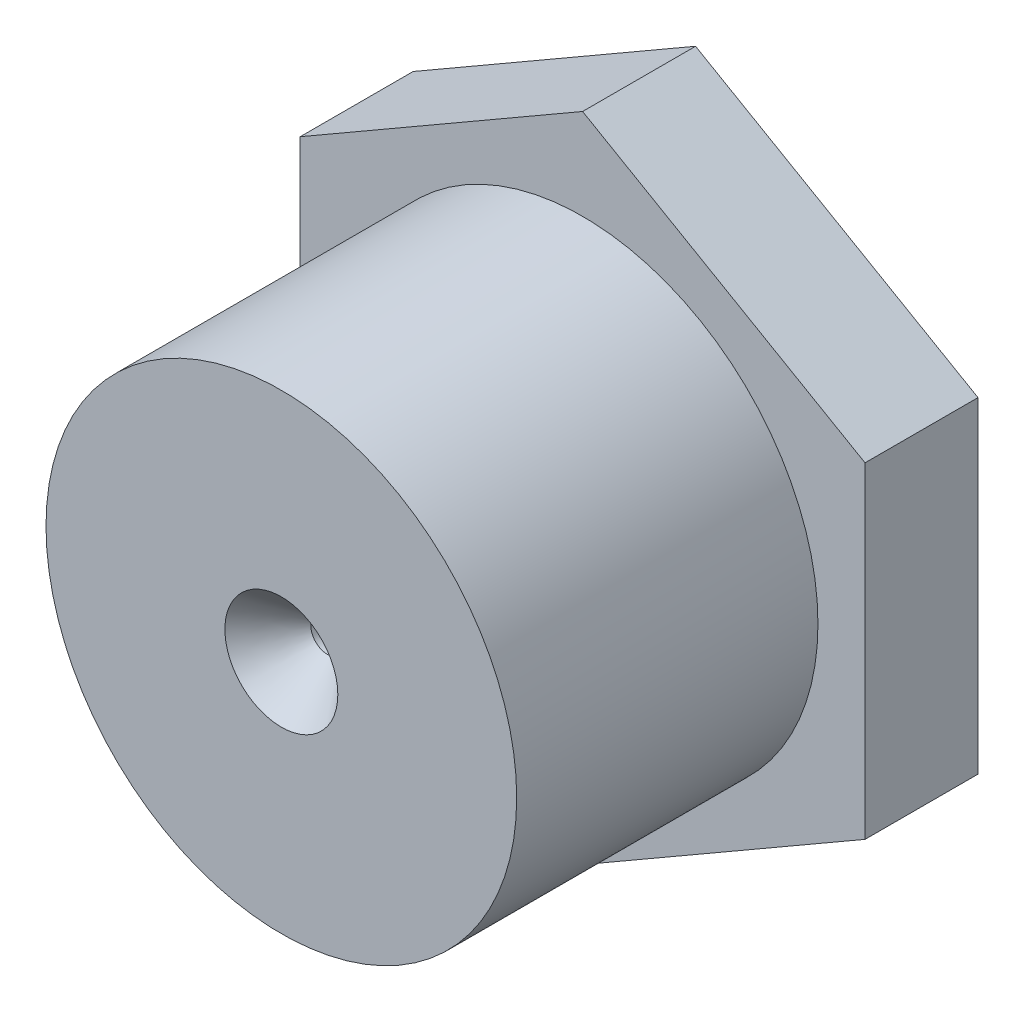
ISO-10303-21;
HEADER;
FILE_DESCRIPTION(('STEP AP214'),'2;1');
FILE_NAME('part.step','',(''),(''),'','','');
FILE_SCHEMA(('AUTOMOTIVE_DESIGN { 1 0 10303 214 1 1 1 1 }'));
ENDSEC;
DATA;
#1=APPLICATION_CONTEXT('core data for automotive mechanical design processes');
#2=APPLICATION_PROTOCOL_DEFINITION('international standard','automotive_design',2000,#1);
#3=PRODUCT_CONTEXT('',#1,'mechanical');
#4=PRODUCT('Part','Part','',(#3));
#5=PRODUCT_RELATED_PRODUCT_CATEGORY('part','',(#4));
#6=PRODUCT_DEFINITION_FORMATION('','',#4);
#7=PRODUCT_DEFINITION_CONTEXT('part definition',#1,'design');
#8=PRODUCT_DEFINITION('design','',#6,#7);
#9=PRODUCT_DEFINITION_SHAPE('','',#8);
#10=(LENGTH_UNIT() NAMED_UNIT(*) SI_UNIT(.MILLI.,.METRE.));
#11=(NAMED_UNIT(*) PLANE_ANGLE_UNIT() SI_UNIT($,.RADIAN.));
#12=(NAMED_UNIT(*) SI_UNIT($,.STERADIAN.) SOLID_ANGLE_UNIT());
#13=UNCERTAINTY_MEASURE_WITH_UNIT(LENGTH_MEASURE(1.E-05),#10,'distance_accuracy_value','');
#14=(GEOMETRIC_REPRESENTATION_CONTEXT(3) GLOBAL_UNCERTAINTY_ASSIGNED_CONTEXT((#13)) GLOBAL_UNIT_ASSIGNED_CONTEXT((#10,
#11,#12)) REPRESENTATION_CONTEXT('',''));
#15=CARTESIAN_POINT('',(0.,0.,0.));
#16=DIRECTION('',(0.,0.,1.));
#17=DIRECTION('',(1.,0.,0.));
#18=AXIS2_PLACEMENT_3D('',#15,#16,#17);
#19=CARTESIAN_POINT('',(0.,17.3205080756888,0.));
#20=DIRECTION('',(0.,0.,1.));
#21=DIRECTION('',(1.,0.,0.));
#22=AXIS2_PLACEMENT_3D('',#19,#20,#21);
#23=PLANE('',#22);
#24=DIRECTION('',(-0.866025403784439,0.5,0.));
#25=VECTOR('',#24,1.);
#26=CARTESIAN_POINT('',(15.,8.6602540378444,0.));
#27=LINE('',#26,#25);
#28=CARTESIAN_POINT('',(15.,8.6602540378444,0.));
#29=VERTEX_POINT('',#28);
#30=CARTESIAN_POINT('',(0.,17.3205080756888,0.));
#31=VERTEX_POINT('',#30);
#32=EDGE_CURVE('E120',#29,#31,#27,.T.);
#33=ORIENTED_EDGE('',*,*,#32,.F.);
#34=DIRECTION('',(0.,1.,0.));
#35=VECTOR('',#34,1.);
#36=CARTESIAN_POINT('',(15.,-8.66025403784439,0.));
#37=LINE('',#36,#35);
#38=CARTESIAN_POINT('',(15.,-8.66025403784439,0.));
#39=VERTEX_POINT('',#38);
#40=EDGE_CURVE('E80',#39,#29,#37,.T.);
#41=ORIENTED_EDGE('',*,*,#40,.F.);
#42=DIRECTION('',(0.866025403784439,0.5,0.));
#43=VECTOR('',#42,1.);
#44=CARTESIAN_POINT('',(0.,-17.3205080756888,0.));
#45=LINE('',#44,#43);
#46=CARTESIAN_POINT('',(0.,-17.3205080756888,0.));
#47=VERTEX_POINT('',#46);
#48=EDGE_CURVE('E74',#47,#39,#45,.T.);
#49=ORIENTED_EDGE('',*,*,#48,.F.);
#50=DIRECTION('',(0.866025403784439,-0.5,0.));
#51=VECTOR('',#50,1.);
#52=CARTESIAN_POINT('',(-15.,-8.66025403784439,0.));
#53=LINE('',#52,#51);
#54=CARTESIAN_POINT('',(-15.,-8.66025403784439,0.));
#55=VERTEX_POINT('',#54);
#56=EDGE_CURVE('E110',#55,#47,#53,.T.);
#57=ORIENTED_EDGE('',*,*,#56,.F.);
#58=DIRECTION('',(0.,-1.,0.));
#59=VECTOR('',#58,1.);
#60=CARTESIAN_POINT('',(-15.,8.66025403784439,0.));
#61=LINE('',#60,#59);
#62=CARTESIAN_POINT('',(-15.,8.66025403784439,0.));
#63=VERTEX_POINT('',#62);
#64=EDGE_CURVE('E126',#63,#55,#61,.T.);
#65=ORIENTED_EDGE('',*,*,#64,.F.);
#66=DIRECTION('',(-0.866025403784439,-0.5,0.));
#67=VECTOR('',#66,1.);
#68=CARTESIAN_POINT('',(0.,17.3205080756888,0.));
#69=LINE('',#68,#67);
#70=EDGE_CURVE('E123',#31,#63,#69,.T.);
#71=ORIENTED_EDGE('',*,*,#70,.F.);
#72=EDGE_LOOP('',(#33,#41,#49,#57,#65,#71));
#73=FACE_BOUND('',#72,.T.);
#74=CARTESIAN_POINT('',(0.,0.,0.));
#75=DIRECTION('',(0.,0.,1.));
#76=DIRECTION('',(1.,0.,0.));
#77=AXIS2_PLACEMENT_3D('',#74,#75,#76);
#78=CIRCLE('',#77,1.50000000000001);
#79=CARTESIAN_POINT('',(1.50000000000001,0.,0.));
#80=VERTEX_POINT('',#79);
#81=EDGE_CURVE('E183',#80,#80,#78,.T.);
#82=ORIENTED_EDGE('',*,*,#81,.T.);
#83=EDGE_LOOP('',(#82));
#84=FACE_BOUND('',#83,.T.);
#85=ADVANCED_FACE('F33',(#73,#84),#23,.F.);
#86=CARTESIAN_POINT('',(0.,0.,22.));
#87=DIRECTION('',(0.,0.,1.));
#88=DIRECTION('',(1.,0.,0.));
#89=AXIS2_PLACEMENT_3D('',#86,#87,#88);
#90=CYLINDRICAL_SURFACE('',#89,0.875000000000006);
#91=CARTESIAN_POINT('',(0.,0.,19.5554671346554));
#92=DIRECTION('',(0.,0.,1.));
#93=DIRECTION('',(1.,0.,0.));
#94=AXIS2_PLACEMENT_3D('',#91,#92,#93);
#95=CIRCLE('',#94,0.875000000000012);
#96=CARTESIAN_POINT('',(0.875000000000012,0.,19.5554671346554));
#97=VERTEX_POINT('',#96);
#98=EDGE_CURVE('E189',#97,#97,#95,.T.);
#99=ORIENTED_EDGE('',*,*,#98,.T.);
#100=EDGE_LOOP('',(#99));
#101=FACE_BOUND('',#100,.T.);
#102=CARTESIAN_POINT('',(0.,0.,0.625000000000004));
#103=DIRECTION('',(0.,0.,-1.));
#104=DIRECTION('',(-1.,0.,0.));
#105=AXIS2_PLACEMENT_3D('',#102,#103,#104);
#106=CIRCLE('',#105,0.875000000000006);
#107=CARTESIAN_POINT('',(-0.875000000000009,0.,0.624999999999999));
#108=VERTEX_POINT('',#107);
#109=EDGE_CURVE('E37',#108,#108,#106,.F.);
#110=ORIENTED_EDGE('',*,*,#109,.F.);
#111=EDGE_LOOP('',(#110));
#112=FACE_BOUND('',#111,.T.);
#113=ADVANCED_FACE('F159',(#101,#112),#90,.F.);
#114=CARTESIAN_POINT('',(0.,17.3205080756888,6.));
#115=DIRECTION('',(0.,0.,1.));
#116=DIRECTION('',(1.,0.,0.));
#117=AXIS2_PLACEMENT_3D('',#114,#115,#116);
#118=PLANE('',#117);
#119=DIRECTION('',(-0.866025403784439,0.5,0.));
#120=VECTOR('',#119,1.);
#121=CARTESIAN_POINT('',(15.,8.6602540378444,6.));
#122=LINE('',#121,#120);
#123=CARTESIAN_POINT('',(15.,8.6602540378444,6.));
#124=VERTEX_POINT('',#123);
#125=CARTESIAN_POINT('',(0.,17.3205080756888,6.));
#126=VERTEX_POINT('',#125);
#127=EDGE_CURVE('E131',#124,#126,#122,.T.);
#128=ORIENTED_EDGE('',*,*,#127,.T.);
#129=DIRECTION('',(-0.866025403784439,-0.5,0.));
#130=VECTOR('',#129,1.);
#131=CARTESIAN_POINT('',(0.,17.3205080756888,6.));
#132=LINE('',#131,#130);
#133=CARTESIAN_POINT('',(-15.,8.66025403784439,6.));
#134=VERTEX_POINT('',#133);
#135=EDGE_CURVE('E88',#126,#134,#132,.T.);
#136=ORIENTED_EDGE('',*,*,#135,.T.);
#137=DIRECTION('',(0.,-1.,0.));
#138=VECTOR('',#137,1.);
#139=CARTESIAN_POINT('',(-15.,8.66025403784439,6.));
#140=LINE('',#139,#138);
#141=CARTESIAN_POINT('',(-15.,-8.66025403784439,6.));
#142=VERTEX_POINT('',#141);
#143=EDGE_CURVE('E102',#134,#142,#140,.T.);
#144=ORIENTED_EDGE('',*,*,#143,.T.);
#145=DIRECTION('',(0.866025403784439,-0.5,0.));
#146=VECTOR('',#145,1.);
#147=CARTESIAN_POINT('',(-15.,-8.66025403784439,6.));
#148=LINE('',#147,#146);
#149=CARTESIAN_POINT('',(0.,-17.3205080756888,6.));
#150=VERTEX_POINT('',#149);
#151=EDGE_CURVE('E95',#142,#150,#148,.T.);
#152=ORIENTED_EDGE('',*,*,#151,.T.);
#153=DIRECTION('',(0.866025403784439,0.5,0.));
#154=VECTOR('',#153,1.);
#155=CARTESIAN_POINT('',(0.,-17.3205080756888,6.));
#156=LINE('',#155,#154);
#157=CARTESIAN_POINT('',(15.,-8.66025403784439,6.));
#158=VERTEX_POINT('',#157);
#159=EDGE_CURVE('E100',#150,#158,#156,.T.);
#160=ORIENTED_EDGE('',*,*,#159,.T.);
#161=DIRECTION('',(0.,1.,0.));
#162=VECTOR('',#161,1.);
#163=CARTESIAN_POINT('',(15.,-8.66025403784439,6.));
#164=LINE('',#163,#162);
#165=EDGE_CURVE('E51',#158,#124,#164,.T.);
#166=ORIENTED_EDGE('',*,*,#165,.T.);
#167=EDGE_LOOP('',(#128,#136,#144,#152,#160,#166));
#168=FACE_BOUND('',#167,.T.);
#169=CARTESIAN_POINT('',(0.,0.,6.));
#170=DIRECTION('',(0.,0.,1.));
#171=DIRECTION('',(1.,0.,0.));
#172=AXIS2_PLACEMENT_3D('',#169,#170,#171);
#173=CIRCLE('',#172,12.5);
#174=CARTESIAN_POINT('',(12.5,0.,6.));
#175=VERTEX_POINT('',#174);
#176=EDGE_CURVE('E195',#175,#175,#173,.T.);
#177=ORIENTED_EDGE('',*,*,#176,.F.);
#178=EDGE_LOOP('',(#177));
#179=FACE_BOUND('',#178,.T.);
#180=ADVANCED_FACE('F97',(#168,#179),#118,.T.);
#181=CARTESIAN_POINT('',(15.,8.6602540378444,6.));
#182=DIRECTION('',(-0.5,-0.866025403784439,0.));
#183=DIRECTION('',(0.866025403784439,-0.5,0.));
#184=AXIS2_PLACEMENT_3D('',#181,#182,#183);
#185=PLANE('',#184);
#186=ORIENTED_EDGE('',*,*,#32,.T.);
#187=DIRECTION('',(0.,0.,-1.));
#188=VECTOR('',#187,1.);
#189=CARTESIAN_POINT('',(0.,17.3205080756888,6.));
#190=LINE('',#189,#188);
#191=EDGE_CURVE('E11',#126,#31,#190,.T.);
#192=ORIENTED_EDGE('',*,*,#191,.F.);
#193=ORIENTED_EDGE('',*,*,#127,.F.);
#194=DIRECTION('',(0.,0.,-1.));
#195=VECTOR('',#194,1.);
#196=CARTESIAN_POINT('',(15.,8.6602540378444,6.));
#197=LINE('',#196,#195);
#198=EDGE_CURVE('E116',#124,#29,#197,.T.);
#199=ORIENTED_EDGE('',*,*,#198,.T.);
#200=EDGE_LOOP('',(#186,#192,#193,#199));
#201=FACE_BOUND('',#200,.T.);
#202=ADVANCED_FACE('F35',(#201),#185,.F.);
#203=CARTESIAN_POINT('',(0.,17.3205080756888,6.));
#204=DIRECTION('',(0.5,-0.866025403784439,0.));
#205=DIRECTION('',(0.866025403784439,0.5,0.));
#206=AXIS2_PLACEMENT_3D('',#203,#204,#205);
#207=PLANE('',#206);
#208=ORIENTED_EDGE('',*,*,#70,.T.);
#209=DIRECTION('',(0.,0.,-1.));
#210=VECTOR('',#209,1.);
#211=CARTESIAN_POINT('',(-15.,8.66025403784439,6.));
#212=LINE('',#211,#210);
#213=EDGE_CURVE('E43',#134,#63,#212,.T.);
#214=ORIENTED_EDGE('',*,*,#213,.F.);
#215=ORIENTED_EDGE('',*,*,#135,.F.);
#216=ORIENTED_EDGE('',*,*,#191,.T.);
#217=EDGE_LOOP('',(#208,#214,#215,#216));
#218=FACE_BOUND('',#217,.T.);
#219=ADVANCED_FACE('F257',(#218),#207,.F.);
#220=CARTESIAN_POINT('',(-15.,8.66025403784439,6.));
#221=DIRECTION('',(1.,0.,0.));
#222=DIRECTION('',(0.,1.,0.));
#223=AXIS2_PLACEMENT_3D('',#220,#221,#222);
#224=PLANE('',#223);
#225=ORIENTED_EDGE('',*,*,#64,.T.);
#226=DIRECTION('',(0.,0.,-1.));
#227=VECTOR('',#226,1.);
#228=CARTESIAN_POINT('',(-15.,-8.66025403784439,6.));
#229=LINE('',#228,#227);
#230=EDGE_CURVE('E111',#142,#55,#229,.T.);
#231=ORIENTED_EDGE('',*,*,#230,.F.);
#232=ORIENTED_EDGE('',*,*,#143,.F.);
#233=ORIENTED_EDGE('',*,*,#213,.T.);
#234=EDGE_LOOP('',(#225,#231,#232,#233));
#235=FACE_BOUND('',#234,.T.);
#236=ADVANCED_FACE('F138',(#235),#224,.F.);
#237=CARTESIAN_POINT('',(-15.,-8.66025403784439,6.));
#238=DIRECTION('',(0.5,0.866025403784439,0.));
#239=DIRECTION('',(-0.866025403784439,0.5,0.));
#240=AXIS2_PLACEMENT_3D('',#237,#238,#239);
#241=PLANE('',#240);
#242=ORIENTED_EDGE('',*,*,#56,.T.);
#243=DIRECTION('',(0.,0.,-1.));
#244=VECTOR('',#243,1.);
#245=CARTESIAN_POINT('',(0.,-17.3205080756888,6.));
#246=LINE('',#245,#244);
#247=EDGE_CURVE('E107',#150,#47,#246,.T.);
#248=ORIENTED_EDGE('',*,*,#247,.F.);
#249=ORIENTED_EDGE('',*,*,#151,.F.);
#250=ORIENTED_EDGE('',*,*,#230,.T.);
#251=EDGE_LOOP('',(#242,#248,#249,#250));
#252=FACE_BOUND('',#251,.T.);
#253=ADVANCED_FACE('F108',(#252),#241,.F.);
#254=CARTESIAN_POINT('',(0.,-17.3205080756888,6.));
#255=DIRECTION('',(-0.5,0.866025403784439,0.));
#256=DIRECTION('',(-0.866025403784439,-0.5,0.));
#257=AXIS2_PLACEMENT_3D('',#254,#255,#256);
#258=PLANE('',#257);
#259=ORIENTED_EDGE('',*,*,#48,.T.);
#260=DIRECTION('',(0.,0.,-1.));
#261=VECTOR('',#260,1.);
#262=CARTESIAN_POINT('',(15.,-8.66025403784439,6.));
#263=LINE('',#262,#261);
#264=EDGE_CURVE('E112',#158,#39,#263,.T.);
#265=ORIENTED_EDGE('',*,*,#264,.F.);
#266=ORIENTED_EDGE('',*,*,#159,.F.);
#267=ORIENTED_EDGE('',*,*,#247,.T.);
#268=EDGE_LOOP('',(#259,#265,#266,#267));
#269=FACE_BOUND('',#268,.T.);
#270=ADVANCED_FACE('F114',(#269),#258,.F.);
#271=CARTESIAN_POINT('',(15.,-8.66025403784439,6.));
#272=DIRECTION('',(-1.,0.,0.));
#273=DIRECTION('',(0.,-1.,0.));
#274=AXIS2_PLACEMENT_3D('',#271,#272,#273);
#275=PLANE('',#274);
#276=ORIENTED_EDGE('',*,*,#40,.T.);
#277=ORIENTED_EDGE('',*,*,#198,.F.);
#278=ORIENTED_EDGE('',*,*,#165,.F.);
#279=ORIENTED_EDGE('',*,*,#264,.T.);
#280=EDGE_LOOP('',(#276,#277,#278,#279));
#281=FACE_BOUND('',#280,.T.);
#282=ADVANCED_FACE('F145',(#281),#275,.F.);
#283=CARTESIAN_POINT('',(0.,0.,22.));
#284=DIRECTION('',(0.,0.,-1.));
#285=DIRECTION('',(-1.,0.,0.));
#286=AXIS2_PLACEMENT_3D('',#283,#284,#285);
#287=CYLINDRICAL_SURFACE('',#286,12.5);
#288=CARTESIAN_POINT('',(0.,0.,22.));
#289=DIRECTION('',(0.,0.,1.));
#290=DIRECTION('',(1.,0.,0.));
#291=AXIS2_PLACEMENT_3D('',#288,#289,#290);
#292=CIRCLE('',#291,12.5);
#293=CARTESIAN_POINT('',(12.5,0.,22.));
#294=VERTEX_POINT('',#293);
#295=EDGE_CURVE('E124',#294,#294,#292,.T.);
#296=ORIENTED_EDGE('',*,*,#295,.F.);
#297=EDGE_LOOP('',(#296));
#298=FACE_BOUND('',#297,.T.);
#299=ORIENTED_EDGE('',*,*,#176,.T.);
#300=EDGE_LOOP('',(#299));
#301=FACE_BOUND('',#300,.T.);
#302=ADVANCED_FACE('F147',(#298,#301),#287,.T.);
#303=CARTESIAN_POINT('',(0.,0.,22.));
#304=DIRECTION('',(0.,0.,1.));
#305=DIRECTION('',(1.,0.,0.));
#306=AXIS2_PLACEMENT_3D('',#303,#304,#305);
#307=PLANE('',#306);
#308=CARTESIAN_POINT('',(0.,0.,22.));
#309=DIRECTION('',(0.,0.,1.));
#310=DIRECTION('',(1.,0.,0.));
#311=AXIS2_PLACEMENT_3D('',#308,#309,#310);
#312=CIRCLE('',#311,3.);
#313=CARTESIAN_POINT('',(3.,0.,22.));
#314=VERTEX_POINT('',#313);
#315=EDGE_CURVE('E187',#314,#314,#312,.T.);
#316=ORIENTED_EDGE('',*,*,#315,.F.);
#317=EDGE_LOOP('',(#316));
#318=FACE_BOUND('',#317,.T.);
#319=ORIENTED_EDGE('',*,*,#295,.T.);
#320=EDGE_LOOP('',(#319));
#321=FACE_BOUND('',#320,.T.);
#322=ADVANCED_FACE('F153',(#318,#321),#307,.T.);
#323=CARTESIAN_POINT('',(0.,0.,22.));
#324=DIRECTION('',(0.,0.,1.));
#325=DIRECTION('',(1.,0.,0.));
#326=AXIS2_PLACEMENT_3D('',#323,#324,#325);
#327=CONICAL_SURFACE('',#326,3.,0.715584993317678);
#328=ORIENTED_EDGE('',*,*,#98,.F.);
#329=EDGE_LOOP('',(#328));
#330=FACE_BOUND('',#329,.T.);
#331=ORIENTED_EDGE('',*,*,#315,.T.);
#332=EDGE_LOOP('',(#331));
#333=FACE_BOUND('',#332,.T.);
#334=ADVANCED_FACE('F169',(#330,#333),#327,.F.);
#335=CARTESIAN_POINT('',(0.,0.,0.));
#336=DIRECTION('',(0.,0.,-1.));
#337=DIRECTION('',(-1.,0.,0.));
#338=AXIS2_PLACEMENT_3D('',#335,#336,#337);
#339=CONICAL_SURFACE('',#338,1.50000000000001,0.785398163397453);
#340=ORIENTED_EDGE('',*,*,#81,.F.);
#341=EDGE_LOOP('',(#340));
#342=FACE_BOUND('',#341,.T.);
#343=ORIENTED_EDGE('',*,*,#109,.T.);
#344=EDGE_LOOP('',(#343));
#345=FACE_BOUND('',#344,.T.);
#346=ADVANCED_FACE('F174',(#342,#345),#339,.F.);
#347=CLOSED_SHELL('',(#85,#113,#180,#202,#219,#236,#253,#270,#282,#302,#322,#334,#346));
#348=MANIFOLD_SOLID_BREP('B2',#347);
#349=ADVANCED_BREP_SHAPE_REPRESENTATION('',(#18,#348),#14);
#350=SHAPE_DEFINITION_REPRESENTATION(#9,#349);
ENDSEC;
END-ISO-10303-21;
